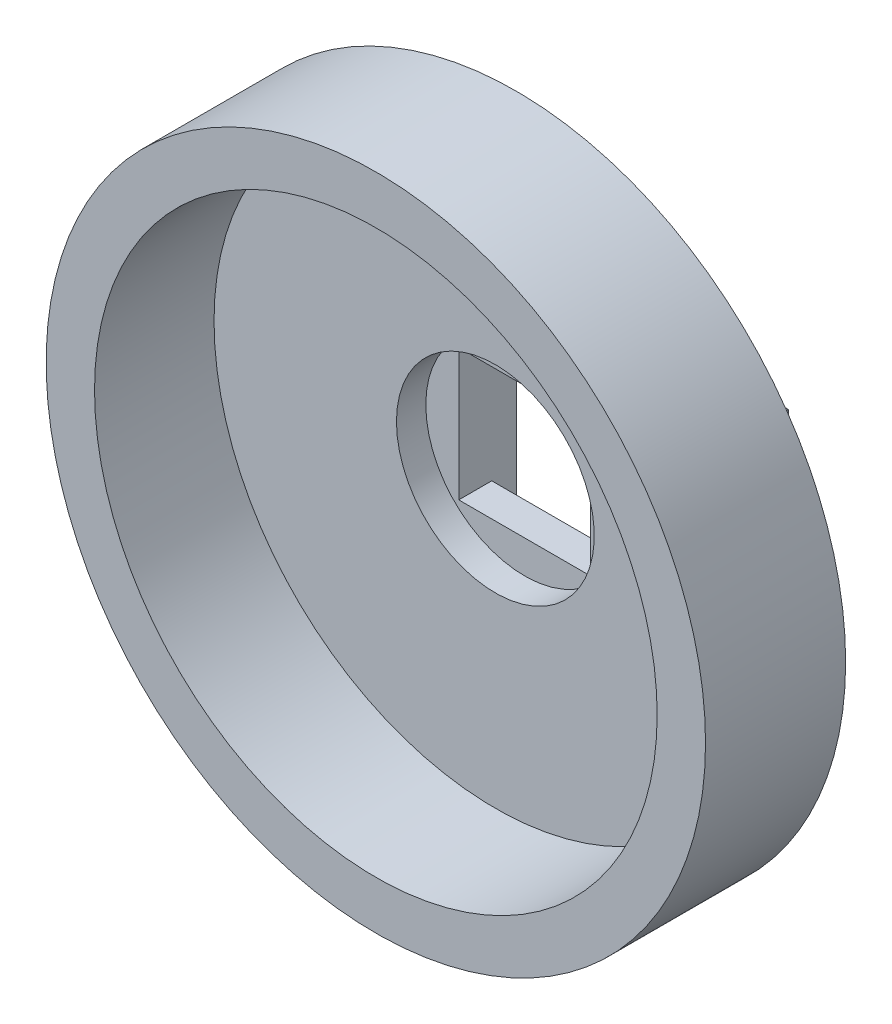
ISO-10303-21;
HEADER;
FILE_DESCRIPTION(('STEP AP214'),'2;1');
FILE_NAME('part.step','',(''),(''),'','','');
FILE_SCHEMA(('AUTOMOTIVE_DESIGN { 1 0 10303 214 1 1 1 1 }'));
ENDSEC;
DATA;
#1=APPLICATION_CONTEXT('core data for automotive mechanical design processes');
#2=APPLICATION_PROTOCOL_DEFINITION('international standard','automotive_design',2000,#1);
#3=PRODUCT_CONTEXT('',#1,'mechanical');
#4=PRODUCT('Part','Part','',(#3));
#5=PRODUCT_RELATED_PRODUCT_CATEGORY('part','',(#4));
#6=PRODUCT_DEFINITION_FORMATION('','',#4);
#7=PRODUCT_DEFINITION_CONTEXT('part definition',#1,'design');
#8=PRODUCT_DEFINITION('design','',#6,#7);
#9=PRODUCT_DEFINITION_SHAPE('','',#8);
#10=(LENGTH_UNIT() NAMED_UNIT(*) SI_UNIT(.MILLI.,.METRE.));
#11=(NAMED_UNIT(*) PLANE_ANGLE_UNIT() SI_UNIT($,.RADIAN.));
#12=(NAMED_UNIT(*) SI_UNIT($,.STERADIAN.) SOLID_ANGLE_UNIT());
#13=UNCERTAINTY_MEASURE_WITH_UNIT(LENGTH_MEASURE(1.E-05),#10,'distance_accuracy_value','');
#14=(GEOMETRIC_REPRESENTATION_CONTEXT(3) GLOBAL_UNCERTAINTY_ASSIGNED_CONTEXT((#13)) GLOBAL_UNIT_ASSIGNED_CONTEXT((#10,
#11,#12)) REPRESENTATION_CONTEXT('',''));
#15=CARTESIAN_POINT('',(0.,0.,0.));
#16=DIRECTION('',(0.,0.,1.));
#17=DIRECTION('',(1.,0.,0.));
#18=AXIS2_PLACEMENT_3D('',#15,#16,#17);
#19=CARTESIAN_POINT('',(0.,0.,0.));
#20=DIRECTION('',(0.,0.,-1.));
#21=DIRECTION('',(-1.,0.,0.));
#22=AXIS2_PLACEMENT_3D('',#19,#20,#21);
#23=PLANE('',#22);
#24=DIRECTION('',(1.,0.,0.));
#25=VECTOR('',#24,1.);
#26=CARTESIAN_POINT('',(0.,0.,0.));
#27=LINE('',#26,#25);
#28=CARTESIAN_POINT('',(16.5,0.,0.));
#29=VERTEX_POINT('',#28);
#30=CARTESIAN_POINT('',(25.,0.,0.));
#31=VERTEX_POINT('',#30);
#32=EDGE_CURVE('E211',#29,#31,#27,.T.);
#33=ORIENTED_EDGE('',*,*,#32,.F.);
#34=DIRECTION('',(0.,1.,0.));
#35=VECTOR('',#34,1.);
#36=CARTESIAN_POINT('',(16.5,0.,0.));
#37=LINE('',#36,#35);
#38=CARTESIAN_POINT('',(16.5,11.75,0.));
#39=VERTEX_POINT('',#38);
#40=EDGE_CURVE('E160',#29,#39,#37,.T.);
#41=ORIENTED_EDGE('',*,*,#40,.T.);
#42=DIRECTION('',(1.,0.,0.));
#43=VECTOR('',#42,1.);
#44=CARTESIAN_POINT('',(0.,11.75,0.));
#45=LINE('',#44,#43);
#46=CARTESIAN_POINT('',(8.5,11.75,0.));
#47=VERTEX_POINT('',#46);
#48=EDGE_CURVE('E166',#47,#39,#45,.T.);
#49=ORIENTED_EDGE('',*,*,#48,.F.);
#50=DIRECTION('',(0.,1.,0.));
#51=VECTOR('',#50,1.);
#52=CARTESIAN_POINT('',(8.5,0.,0.));
#53=LINE('',#52,#51);
#54=CARTESIAN_POINT('',(8.5,0.,0.));
#55=VERTEX_POINT('',#54);
#56=EDGE_CURVE('E163',#55,#47,#53,.T.);
#57=ORIENTED_EDGE('',*,*,#56,.F.);
#58=CARTESIAN_POINT('',(0.,0.,0.));
#59=VERTEX_POINT('',#58);
#60=EDGE_CURVE('E212',#59,#55,#27,.T.);
#61=ORIENTED_EDGE('',*,*,#60,.F.);
#62=DIRECTION('',(0.,-1.,0.));
#63=VECTOR('',#62,1.);
#64=CARTESIAN_POINT('',(0.,0.,0.));
#65=LINE('',#64,#63);
#66=CARTESIAN_POINT('',(0.,15.,0.));
#67=VERTEX_POINT('',#66);
#68=EDGE_CURVE('E197',#67,#59,#65,.T.);
#69=ORIENTED_EDGE('',*,*,#68,.F.);
#70=DIRECTION('',(-1.,0.,0.));
#71=VECTOR('',#70,1.);
#72=CARTESIAN_POINT('',(0.,15.,0.));
#73=LINE('',#72,#71);
#74=CARTESIAN_POINT('',(25.,15.,0.));
#75=VERTEX_POINT('',#74);
#76=EDGE_CURVE('E75',#75,#67,#73,.T.);
#77=ORIENTED_EDGE('',*,*,#76,.F.);
#78=DIRECTION('',(0.,1.,0.));
#79=VECTOR('',#78,1.);
#80=CARTESIAN_POINT('',(25.,0.,0.));
#81=LINE('',#80,#79);
#82=EDGE_CURVE('E70',#31,#75,#81,.T.);
#83=ORIENTED_EDGE('',*,*,#82,.F.);
#84=EDGE_LOOP('',(#33,#41,#49,#57,#61,#69,#77,#83));
#85=FACE_BOUND('',#84,.T.);
#86=CARTESIAN_POINT('',(2.,7.5,0.));
#87=DIRECTION('',(0.,0.,-1.));
#88=DIRECTION('',(-1.,0.,0.));
#89=AXIS2_PLACEMENT_3D('',#86,#87,#88);
#90=CIRCLE('',#89,0.79999999999999);
#91=CARTESIAN_POINT('',(1.20000000000001,7.5,0.));
#92=VERTEX_POINT('',#91);
#93=EDGE_CURVE('E191',#92,#92,#90,.T.);
#94=ORIENTED_EDGE('',*,*,#93,.F.);
#95=EDGE_LOOP('',(#94));
#96=FACE_BOUND('',#95,.T.);
#97=CARTESIAN_POINT('',(23.,7.5,0.));
#98=DIRECTION('',(0.,0.,-1.));
#99=DIRECTION('',(-1.,0.,0.));
#100=AXIS2_PLACEMENT_3D('',#97,#98,#99);
#101=CIRCLE('',#100,0.799999999999988);
#102=CARTESIAN_POINT('',(22.2,7.5,0.));
#103=VERTEX_POINT('',#102);
#104=EDGE_CURVE('E183',#103,#103,#101,.T.);
#105=ORIENTED_EDGE('',*,*,#104,.F.);
#106=EDGE_LOOP('',(#105));
#107=FACE_BOUND('',#106,.T.);
#108=ADVANCED_FACE('F36',(#85,#96,#107),#23,.T.);
#109=CARTESIAN_POINT('',(0.,0.,4.03));
#110=DIRECTION('',(1.,0.,0.));
#111=DIRECTION('',(0.,0.,-1.));
#112=AXIS2_PLACEMENT_3D('',#109,#110,#111);
#113=PLANE('',#112);
#114=ORIENTED_EDGE('',*,*,#68,.T.);
#115=DIRECTION('',(0.,0.,-1.));
#116=VECTOR('',#115,1.);
#117=CARTESIAN_POINT('',(0.,0.,4.03));
#118=LINE('',#117,#116);
#119=CARTESIAN_POINT('',(0.,0.,4.03));
#120=VERTEX_POINT('',#119);
#121=EDGE_CURVE('E11',#120,#59,#118,.T.);
#122=ORIENTED_EDGE('',*,*,#121,.F.);
#123=DIRECTION('',(0.,-1.,0.));
#124=VECTOR('',#123,1.);
#125=CARTESIAN_POINT('',(0.,0.,4.03));
#126=LINE('',#125,#124);
#127=CARTESIAN_POINT('',(0.,15.,4.03));
#128=VERTEX_POINT('',#127);
#129=EDGE_CURVE('E198',#128,#120,#126,.T.);
#130=ORIENTED_EDGE('',*,*,#129,.F.);
#131=DIRECTION('',(0.,0.,-1.));
#132=VECTOR('',#131,1.);
#133=CARTESIAN_POINT('',(0.,15.,4.03));
#134=LINE('',#133,#132);
#135=EDGE_CURVE('E208',#128,#67,#134,.T.);
#136=ORIENTED_EDGE('',*,*,#135,.T.);
#137=EDGE_LOOP('',(#114,#122,#130,#136));
#138=FACE_BOUND('',#137,.T.);
#139=ADVANCED_FACE('F38',(#138),#113,.F.);
#140=CARTESIAN_POINT('',(0.,0.,4.03));
#141=DIRECTION('',(0.,1.,0.));
#142=DIRECTION('',(0.,0.,1.));
#143=AXIS2_PLACEMENT_3D('',#140,#141,#142);
#144=PLANE('',#143);
#145=DIRECTION('',(1.,0.,0.));
#146=VECTOR('',#145,1.);
#147=CARTESIAN_POINT('',(0.,0.,1.5));
#148=LINE('',#147,#146);
#149=CARTESIAN_POINT('',(8.5,0.,1.5));
#150=VERTEX_POINT('',#149);
#151=CARTESIAN_POINT('',(16.5,0.,1.5));
#152=VERTEX_POINT('',#151);
#153=EDGE_CURVE('E264',#150,#152,#148,.T.);
#154=ORIENTED_EDGE('',*,*,#153,.T.);
#155=DIRECTION('',(0.,0.,-1.));
#156=VECTOR('',#155,1.);
#157=CARTESIAN_POINT('',(16.5,0.,4.03));
#158=LINE('',#157,#156);
#159=EDGE_CURVE('E164',#152,#29,#158,.T.);
#160=ORIENTED_EDGE('',*,*,#159,.T.);
#161=ORIENTED_EDGE('',*,*,#32,.T.);
#162=DIRECTION('',(0.,0.,-1.));
#163=VECTOR('',#162,1.);
#164=CARTESIAN_POINT('',(25.,0.,4.03));
#165=LINE('',#164,#163);
#166=CARTESIAN_POINT('',(25.,0.,4.03));
#167=VERTEX_POINT('',#166);
#168=EDGE_CURVE('E46',#167,#31,#165,.T.);
#169=ORIENTED_EDGE('',*,*,#168,.F.);
#170=DIRECTION('',(1.,0.,0.));
#171=VECTOR('',#170,1.);
#172=CARTESIAN_POINT('',(0.,0.,4.03));
#173=LINE('',#172,#171);
#174=EDGE_CURVE('E80',#120,#167,#173,.T.);
#175=ORIENTED_EDGE('',*,*,#174,.F.);
#176=ORIENTED_EDGE('',*,*,#121,.T.);
#177=ORIENTED_EDGE('',*,*,#60,.T.);
#178=DIRECTION('',(0.,0.,1.));
#179=VECTOR('',#178,1.);
#180=CARTESIAN_POINT('',(8.5,0.,4.03));
#181=LINE('',#180,#179);
#182=EDGE_CURVE('E266',#55,#150,#181,.T.);
#183=ORIENTED_EDGE('',*,*,#182,.T.);
#184=EDGE_LOOP('',(#154,#160,#161,#169,#175,#176,#177,#183));
#185=FACE_BOUND('',#184,.T.);
#186=ADVANCED_FACE('F250',(#185),#144,.F.);
#187=CARTESIAN_POINT('',(25.,0.,4.03));
#188=DIRECTION('',(-1.,0.,0.));
#189=DIRECTION('',(0.,0.,1.));
#190=AXIS2_PLACEMENT_3D('',#187,#188,#189);
#191=PLANE('',#190);
#192=ORIENTED_EDGE('',*,*,#82,.T.);
#193=DIRECTION('',(0.,0.,-1.));
#194=VECTOR('',#193,1.);
#195=CARTESIAN_POINT('',(25.,15.,4.03));
#196=LINE('',#195,#194);
#197=CARTESIAN_POINT('',(25.,15.,4.03));
#198=VERTEX_POINT('',#197);
#199=EDGE_CURVE('E54',#198,#75,#196,.T.);
#200=ORIENTED_EDGE('',*,*,#199,.F.);
#201=DIRECTION('',(0.,1.,0.));
#202=VECTOR('',#201,1.);
#203=CARTESIAN_POINT('',(25.,0.,4.03));
#204=LINE('',#203,#202);
#205=EDGE_CURVE('E202',#167,#198,#204,.T.);
#206=ORIENTED_EDGE('',*,*,#205,.F.);
#207=ORIENTED_EDGE('',*,*,#168,.T.);
#208=EDGE_LOOP('',(#192,#200,#206,#207));
#209=FACE_BOUND('',#208,.T.);
#210=ADVANCED_FACE('F219',(#209),#191,.F.);
#211=CARTESIAN_POINT('',(0.,15.,4.03));
#212=DIRECTION('',(0.,-1.,0.));
#213=DIRECTION('',(0.,0.,-1.));
#214=AXIS2_PLACEMENT_3D('',#211,#212,#213);
#215=PLANE('',#214);
#216=ORIENTED_EDGE('',*,*,#76,.T.);
#217=ORIENTED_EDGE('',*,*,#135,.F.);
#218=DIRECTION('',(-1.,0.,0.));
#219=VECTOR('',#218,1.);
#220=CARTESIAN_POINT('',(0.,15.,4.03));
#221=LINE('',#220,#219);
#222=EDGE_CURVE('E205',#198,#128,#221,.T.);
#223=ORIENTED_EDGE('',*,*,#222,.F.);
#224=ORIENTED_EDGE('',*,*,#199,.T.);
#225=EDGE_LOOP('',(#216,#217,#223,#224));
#226=FACE_BOUND('',#225,.T.);
#227=ADVANCED_FACE('F225',(#226),#215,.F.);
#228=CARTESIAN_POINT('',(2.,7.5,3.));
#229=DIRECTION('',(0.,0.,-1.));
#230=DIRECTION('',(-1.,0.,0.));
#231=AXIS2_PLACEMENT_3D('',#228,#229,#230);
#232=CONICAL_SURFACE('',#231,0.799999999999999,1.02974425867665);
#233=CARTESIAN_POINT('',(2.,7.5,3.48068849522205));
#234=VERTEX_POINT('',#233);
#235=VERTEX_LOOP('',#234);
#236=FACE_BOUND('',#235,.T.);
#237=CARTESIAN_POINT('',(2.,7.5,3.));
#238=DIRECTION('',(0.,0.,-1.));
#239=DIRECTION('',(-1.,0.,0.));
#240=AXIS2_PLACEMENT_3D('',#237,#238,#239);
#241=CIRCLE('',#240,0.799999999999999);
#242=CARTESIAN_POINT('',(1.2,7.5,3.));
#243=VERTEX_POINT('',#242);
#244=EDGE_CURVE('E194',#243,#243,#241,.T.);
#245=ORIENTED_EDGE('',*,*,#244,.T.);
#246=EDGE_LOOP('',(#245));
#247=FACE_BOUND('',#246,.T.);
#248=ADVANCED_FACE('F253',(#236,#247),#232,.F.);
#249=CARTESIAN_POINT('',(2.,7.5,0.));
#250=DIRECTION('',(0.,0.,-1.));
#251=DIRECTION('',(-1.,0.,0.));
#252=AXIS2_PLACEMENT_3D('',#249,#250,#251);
#253=CYLINDRICAL_SURFACE('',#252,0.799999999999995);
#254=ORIENTED_EDGE('',*,*,#244,.F.);
#255=EDGE_LOOP('',(#254));
#256=FACE_BOUND('',#255,.T.);
#257=ORIENTED_EDGE('',*,*,#93,.T.);
#258=EDGE_LOOP('',(#257));
#259=FACE_BOUND('',#258,.T.);
#260=ADVANCED_FACE('F403',(#256,#259),#253,.F.);
#261=CARTESIAN_POINT('',(23.,7.5,3.));
#262=DIRECTION('',(0.,0.,-1.));
#263=DIRECTION('',(-1.,0.,0.));
#264=AXIS2_PLACEMENT_3D('',#261,#262,#263);
#265=CONICAL_SURFACE('',#264,0.799999999999999,1.02974425867665);
#266=CARTESIAN_POINT('',(23.,7.5,3.48068849522205));
#267=VERTEX_POINT('',#266);
#268=VERTEX_LOOP('',#267);
#269=FACE_BOUND('',#268,.T.);
#270=CARTESIAN_POINT('',(23.,7.5,3.));
#271=DIRECTION('',(0.,0.,-1.));
#272=DIRECTION('',(-1.,0.,0.));
#273=AXIS2_PLACEMENT_3D('',#270,#271,#272);
#274=CIRCLE('',#273,0.799999999999999);
#275=CARTESIAN_POINT('',(22.2,7.5,3.));
#276=VERTEX_POINT('',#275);
#277=EDGE_CURVE('E188',#276,#276,#274,.T.);
#278=ORIENTED_EDGE('',*,*,#277,.T.);
#279=EDGE_LOOP('',(#278));
#280=FACE_BOUND('',#279,.T.);
#281=ADVANCED_FACE('F240',(#269,#280),#265,.F.);
#282=CARTESIAN_POINT('',(23.,7.5,0.));
#283=DIRECTION('',(0.,0.,-1.));
#284=DIRECTION('',(-1.,0.,0.));
#285=AXIS2_PLACEMENT_3D('',#282,#283,#284);
#286=CYLINDRICAL_SURFACE('',#285,0.799999999999993);
#287=ORIENTED_EDGE('',*,*,#277,.F.);
#288=EDGE_LOOP('',(#287));
#289=FACE_BOUND('',#288,.T.);
#290=ORIENTED_EDGE('',*,*,#104,.T.);
#291=EDGE_LOOP('',(#290));
#292=FACE_BOUND('',#291,.T.);
#293=ADVANCED_FACE('F230',(#289,#292),#286,.F.);
#294=CARTESIAN_POINT('',(12.5,7.5,4.03));
#295=DIRECTION('',(0.,0.,1.));
#296=DIRECTION('',(1.,0.,0.));
#297=AXIS2_PLACEMENT_3D('',#294,#295,#296);
#298=PLANE('',#297);
#299=CARTESIAN_POINT('',(12.5,7.5,4.03));
#300=DIRECTION('',(0.,0.,1.));
#301=DIRECTION('',(1.,0.,0.));
#302=AXIS2_PLACEMENT_3D('',#299,#300,#301);
#303=CIRCLE('',#302,20.);
#304=CARTESIAN_POINT('',(32.5,7.5,4.03));
#305=VERTEX_POINT('',#304);
#306=EDGE_CURVE('E179',#305,#305,#303,.T.);
#307=ORIENTED_EDGE('',*,*,#306,.F.);
#308=EDGE_LOOP('',(#307));
#309=FACE_BOUND('',#308,.T.);
#310=ORIENTED_EDGE('',*,*,#222,.T.);
#311=ORIENTED_EDGE('',*,*,#129,.T.);
#312=ORIENTED_EDGE('',*,*,#174,.T.);
#313=ORIENTED_EDGE('',*,*,#205,.T.);
#314=EDGE_LOOP('',(#310,#311,#312,#313));
#315=FACE_BOUND('',#314,.T.);
#316=ADVANCED_FACE('F227',(#309,#315),#298,.F.);
#317=CARTESIAN_POINT('',(12.5,7.5,12.53));
#318=DIRECTION('',(0.,0.,-1.));
#319=DIRECTION('',(-1.,0.,0.));
#320=AXIS2_PLACEMENT_3D('',#317,#318,#319);
#321=CYLINDRICAL_SURFACE('',#320,20.);
#322=CARTESIAN_POINT('',(12.5,7.5,12.53));
#323=DIRECTION('',(0.,0.,1.));
#324=DIRECTION('',(1.,0.,0.));
#325=AXIS2_PLACEMENT_3D('',#322,#323,#324);
#326=CIRCLE('',#325,20.);
#327=CARTESIAN_POINT('',(32.5,7.5,12.53));
#328=VERTEX_POINT('',#327);
#329=EDGE_CURVE('E180',#328,#328,#326,.T.);
#330=ORIENTED_EDGE('',*,*,#329,.F.);
#331=EDGE_LOOP('',(#330));
#332=FACE_BOUND('',#331,.T.);
#333=ORIENTED_EDGE('',*,*,#306,.T.);
#334=EDGE_LOOP('',(#333));
#335=FACE_BOUND('',#334,.T.);
#336=ADVANCED_FACE('F229',(#332,#335),#321,.T.);
#337=CARTESIAN_POINT('',(12.5,7.5,12.53));
#338=DIRECTION('',(0.,0.,1.));
#339=DIRECTION('',(1.,0.,0.));
#340=AXIS2_PLACEMENT_3D('',#337,#338,#339);
#341=PLANE('',#340);
#342=CARTESIAN_POINT('',(12.5,7.5,12.53));
#343=DIRECTION('',(0.,0.,1.));
#344=DIRECTION('',(1.,0.,0.));
#345=AXIS2_PLACEMENT_3D('',#342,#343,#344);
#346=CIRCLE('',#345,17.06626);
#347=CARTESIAN_POINT('',(29.56626,7.5,12.53));
#348=VERTEX_POINT('',#347);
#349=EDGE_CURVE('E171',#348,#348,#346,.T.);
#350=ORIENTED_EDGE('',*,*,#349,.F.);
#351=EDGE_LOOP('',(#350));
#352=FACE_BOUND('',#351,.T.);
#353=ORIENTED_EDGE('',*,*,#329,.T.);
#354=EDGE_LOOP('',(#353));
#355=FACE_BOUND('',#354,.T.);
#356=ADVANCED_FACE('F237',(#352,#355),#341,.T.);
#357=CARTESIAN_POINT('',(12.5,7.5,5.28));
#358=DIRECTION('',(0.,0.,-1.));
#359=DIRECTION('',(-1.,0.,0.));
#360=AXIS2_PLACEMENT_3D('',#357,#358,#359);
#361=PLANE('',#360);
#362=CARTESIAN_POINT('',(12.5,7.75,5.28));
#363=DIRECTION('',(0.,0.,-1.));
#364=DIRECTION('',(-1.,0.,0.));
#365=AXIS2_PLACEMENT_3D('',#362,#363,#364);
#366=CIRCLE('',#365,6.);
#367=CARTESIAN_POINT('',(6.5,7.75,5.28));
#368=VERTEX_POINT('',#367);
#369=EDGE_CURVE('E40',#368,#368,#366,.T.);
#370=ORIENTED_EDGE('',*,*,#369,.T.);
#371=EDGE_LOOP('',(#370));
#372=FACE_BOUND('',#371,.T.);
#373=CARTESIAN_POINT('',(12.5,7.5,5.28));
#374=DIRECTION('',(0.,0.,1.));
#375=DIRECTION('',(1.,0.,0.));
#376=AXIS2_PLACEMENT_3D('',#373,#374,#375);
#377=CIRCLE('',#376,17.06626);
#378=CARTESIAN_POINT('',(29.56626,7.5,5.28));
#379=VERTEX_POINT('',#378);
#380=EDGE_CURVE('E176',#379,#379,#377,.T.);
#381=ORIENTED_EDGE('',*,*,#380,.T.);
#382=EDGE_LOOP('',(#381));
#383=FACE_BOUND('',#382,.T.);
#384=ADVANCED_FACE('F292',(#372,#383),#361,.F.);
#385=CARTESIAN_POINT('',(12.5,7.5,12.53));
#386=DIRECTION('',(0.,0.,1.));
#387=DIRECTION('',(1.,0.,0.));
#388=AXIS2_PLACEMENT_3D('',#385,#386,#387);
#389=CYLINDRICAL_SURFACE('',#388,17.06626);
#390=ORIENTED_EDGE('',*,*,#380,.F.);
#391=EDGE_LOOP('',(#390));
#392=FACE_BOUND('',#391,.T.);
#393=ORIENTED_EDGE('',*,*,#349,.T.);
#394=EDGE_LOOP('',(#393));
#395=FACE_BOUND('',#394,.T.);
#396=ADVANCED_FACE('F313',(#392,#395),#389,.F.);
#397=CARTESIAN_POINT('',(16.5,0.,3.5));
#398=DIRECTION('',(-1.,0.,0.));
#399=DIRECTION('',(0.,0.,1.));
#400=AXIS2_PLACEMENT_3D('',#397,#398,#399);
#401=PLANE('',#400);
#402=ORIENTED_EDGE('',*,*,#40,.F.);
#403=ORIENTED_EDGE('',*,*,#159,.F.);
#404=DIRECTION('',(0.,1.,0.));
#405=VECTOR('',#404,1.);
#406=CARTESIAN_POINT('',(16.5,-9.75,1.5));
#407=LINE('',#406,#405);
#408=CARTESIAN_POINT('',(16.5,3.75,1.5));
#409=VERTEX_POINT('',#408);
#410=EDGE_CURVE('E271',#152,#409,#407,.T.);
#411=ORIENTED_EDGE('',*,*,#410,.T.);
#412=DIRECTION('',(0.,0.,-1.));
#413=VECTOR('',#412,1.);
#414=CARTESIAN_POINT('',(16.5,3.75,3.5));
#415=LINE('',#414,#413);
#416=CARTESIAN_POINT('',(16.5,3.75,3.5));
#417=VERTEX_POINT('',#416);
#418=EDGE_CURVE('E150',#417,#409,#415,.T.);
#419=ORIENTED_EDGE('',*,*,#418,.F.);
#420=DIRECTION('',(0.,1.,0.));
#421=VECTOR('',#420,1.);
#422=CARTESIAN_POINT('',(16.5,0.,3.5));
#423=LINE('',#422,#421);
#424=CARTESIAN_POINT('',(16.5,11.75,3.5));
#425=VERTEX_POINT('',#424);
#426=EDGE_CURVE('E136',#417,#425,#423,.T.);
#427=ORIENTED_EDGE('',*,*,#426,.T.);
#428=DIRECTION('',(0.,0.,-1.));
#429=VECTOR('',#428,1.);
#430=CARTESIAN_POINT('',(16.5,11.75,3.5));
#431=LINE('',#430,#429);
#432=EDGE_CURVE('E169',#425,#39,#431,.T.);
#433=ORIENTED_EDGE('',*,*,#432,.T.);
#434=EDGE_LOOP('',(#402,#403,#411,#419,#427,#433));
#435=FACE_BOUND('',#434,.T.);
#436=ADVANCED_FACE('F276',(#435),#401,.T.);
#437=CARTESIAN_POINT('',(0.,11.75,3.5));
#438=DIRECTION('',(0.,1.,0.));
#439=DIRECTION('',(-1.,0.,0.));
#440=AXIS2_PLACEMENT_3D('',#437,#438,#439);
#441=PLANE('',#440);
#442=ORIENTED_EDGE('',*,*,#48,.T.);
#443=ORIENTED_EDGE('',*,*,#432,.F.);
#444=DIRECTION('',(1.,0.,0.));
#445=VECTOR('',#444,1.);
#446=CARTESIAN_POINT('',(0.,11.75,3.5));
#447=LINE('',#446,#445);
#448=CARTESIAN_POINT('',(8.5,11.75,3.5));
#449=VERTEX_POINT('',#448);
#450=EDGE_CURVE('E155',#449,#425,#447,.T.);
#451=ORIENTED_EDGE('',*,*,#450,.F.);
#452=DIRECTION('',(0.,0.,-1.));
#453=VECTOR('',#452,1.);
#454=CARTESIAN_POINT('',(8.5,11.75,3.5));
#455=LINE('',#454,#453);
#456=EDGE_CURVE('E149',#449,#47,#455,.T.);
#457=ORIENTED_EDGE('',*,*,#456,.T.);
#458=EDGE_LOOP('',(#442,#443,#451,#457));
#459=FACE_BOUND('',#458,.T.);
#460=ADVANCED_FACE('F278',(#459),#441,.F.);
#461=CARTESIAN_POINT('',(8.5,0.,3.5));
#462=DIRECTION('',(-1.,0.,0.));
#463=DIRECTION('',(0.,0.,1.));
#464=AXIS2_PLACEMENT_3D('',#461,#462,#463);
#465=PLANE('',#464);
#466=ORIENTED_EDGE('',*,*,#56,.T.);
#467=ORIENTED_EDGE('',*,*,#456,.F.);
#468=DIRECTION('',(0.,1.,0.));
#469=VECTOR('',#468,1.);
#470=CARTESIAN_POINT('',(8.5,0.,3.5));
#471=LINE('',#470,#469);
#472=CARTESIAN_POINT('',(8.5,3.75,3.5));
#473=VERTEX_POINT('',#472);
#474=EDGE_CURVE('E133',#473,#449,#471,.T.);
#475=ORIENTED_EDGE('',*,*,#474,.F.);
#476=DIRECTION('',(0.,0.,-1.));
#477=VECTOR('',#476,1.);
#478=CARTESIAN_POINT('',(8.5,3.75,3.5));
#479=LINE('',#478,#477);
#480=CARTESIAN_POINT('',(8.5,3.75,1.5));
#481=VERTEX_POINT('',#480);
#482=EDGE_CURVE('E143',#473,#481,#479,.T.);
#483=ORIENTED_EDGE('',*,*,#482,.T.);
#484=DIRECTION('',(0.,1.,0.));
#485=VECTOR('',#484,1.);
#486=CARTESIAN_POINT('',(8.5,-9.75,1.5));
#487=LINE('',#486,#485);
#488=EDGE_CURVE('E281',#150,#481,#487,.T.);
#489=ORIENTED_EDGE('',*,*,#488,.F.);
#490=ORIENTED_EDGE('',*,*,#182,.F.);
#491=EDGE_LOOP('',(#466,#467,#475,#483,#489,#490));
#492=FACE_BOUND('',#491,.T.);
#493=ADVANCED_FACE('F153',(#492),#465,.F.);
#494=CARTESIAN_POINT('',(0.,3.75,3.5));
#495=DIRECTION('',(0.,1.,0.));
#496=DIRECTION('',(-1.,0.,0.));
#497=AXIS2_PLACEMENT_3D('',#494,#495,#496);
#498=PLANE('',#497);
#499=DIRECTION('',(1.,0.,0.));
#500=VECTOR('',#499,1.);
#501=CARTESIAN_POINT('',(16.5,3.75,1.5));
#502=LINE('',#501,#500);
#503=EDGE_CURVE('E146',#481,#409,#502,.T.);
#504=ORIENTED_EDGE('',*,*,#503,.F.);
#505=ORIENTED_EDGE('',*,*,#482,.F.);
#506=DIRECTION('',(1.,0.,0.));
#507=VECTOR('',#506,1.);
#508=CARTESIAN_POINT('',(0.,3.75,3.5));
#509=LINE('',#508,#507);
#510=EDGE_CURVE('E128',#473,#417,#509,.T.);
#511=ORIENTED_EDGE('',*,*,#510,.T.);
#512=ORIENTED_EDGE('',*,*,#418,.T.);
#513=EDGE_LOOP('',(#504,#505,#511,#512));
#514=FACE_BOUND('',#513,.T.);
#515=ADVANCED_FACE('F144',(#514),#498,.T.);
#516=CARTESIAN_POINT('',(16.5,-9.75,1.5));
#517=DIRECTION('',(0.,0.,1.));
#518=DIRECTION('',(1.,0.,0.));
#519=AXIS2_PLACEMENT_3D('',#516,#517,#518);
#520=PLANE('',#519);
#521=ORIENTED_EDGE('',*,*,#488,.T.);
#522=ORIENTED_EDGE('',*,*,#503,.T.);
#523=ORIENTED_EDGE('',*,*,#410,.F.);
#524=ORIENTED_EDGE('',*,*,#153,.F.);
#525=EDGE_LOOP('',(#521,#522,#523,#524));
#526=FACE_BOUND('',#525,.T.);
#527=ADVANCED_FACE('F280',(#526),#520,.F.);
#528=CARTESIAN_POINT('',(12.5,7.75,17.));
#529=DIRECTION('',(0.,0.,-1.));
#530=DIRECTION('',(-1.,0.,0.));
#531=AXIS2_PLACEMENT_3D('',#528,#529,#530);
#532=CYLINDRICAL_SURFACE('',#531,6.);
#533=CARTESIAN_POINT('',(12.5,7.75,3.5));
#534=DIRECTION('',(0.,0.,-1.));
#535=DIRECTION('',(-1.,0.,0.));
#536=AXIS2_PLACEMENT_3D('',#533,#534,#535);
#537=CIRCLE('',#536,6.);
#538=CARTESIAN_POINT('',(6.5,7.75,3.5));
#539=VERTEX_POINT('',#538);
#540=EDGE_CURVE('E285',#539,#539,#537,.T.);
#541=ORIENTED_EDGE('',*,*,#540,.T.);
#542=EDGE_LOOP('',(#541));
#543=FACE_BOUND('',#542,.T.);
#544=ORIENTED_EDGE('',*,*,#369,.F.);
#545=EDGE_LOOP('',(#544));
#546=FACE_BOUND('',#545,.T.);
#547=ADVANCED_FACE('F295',(#543,#546),#532,.F.);
#548=CARTESIAN_POINT('',(12.5,7.75,3.5));
#549=DIRECTION('',(0.,0.,-1.));
#550=DIRECTION('',(-1.,0.,0.));
#551=AXIS2_PLACEMENT_3D('',#548,#549,#550);
#552=PLANE('',#551);
#553=ORIENTED_EDGE('',*,*,#426,.F.);
#554=ORIENTED_EDGE('',*,*,#510,.F.);
#555=ORIENTED_EDGE('',*,*,#474,.T.);
#556=ORIENTED_EDGE('',*,*,#450,.T.);
#557=EDGE_LOOP('',(#553,#554,#555,#556));
#558=FACE_BOUND('',#557,.T.);
#559=ORIENTED_EDGE('',*,*,#540,.F.);
#560=EDGE_LOOP('',(#559));
#561=FACE_BOUND('',#560,.T.);
#562=ADVANCED_FACE('F130',(#558,#561),#552,.F.);
#563=CLOSED_SHELL('',(#108,#139,#186,#210,#227,#248,#260,#281,#293,#316,#336,#356,#384,#396,
#436,#460,#493,#515,#527,#547,#562));
#564=MANIFOLD_SOLID_BREP('B2',#563);
#565=ADVANCED_BREP_SHAPE_REPRESENTATION('',(#18,#564),#14);
#566=SHAPE_DEFINITION_REPRESENTATION(#9,#565);
ENDSEC;
END-ISO-10303-21;
